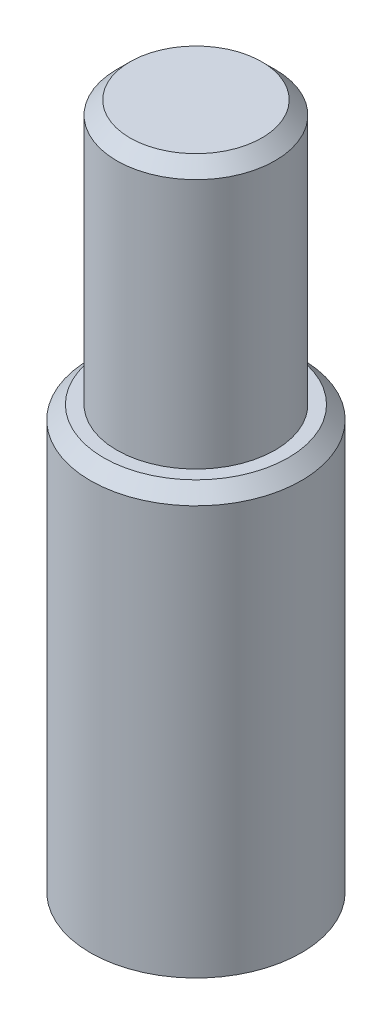
ISO-10303-21;
HEADER;
FILE_DESCRIPTION(('STEP AP214'),'2;1');
FILE_NAME('part.step','',(''),(''),'','','');
FILE_SCHEMA(('AUTOMOTIVE_DESIGN { 1 0 10303 214 1 1 1 1 }'));
ENDSEC;
DATA;
#1=APPLICATION_CONTEXT('core data for automotive mechanical design processes');
#2=APPLICATION_PROTOCOL_DEFINITION('international standard','automotive_design',2000,#1);
#3=PRODUCT_CONTEXT('',#1,'mechanical');
#4=PRODUCT('Part','Part','',(#3));
#5=PRODUCT_RELATED_PRODUCT_CATEGORY('part','',(#4));
#6=PRODUCT_DEFINITION_FORMATION('','',#4);
#7=PRODUCT_DEFINITION_CONTEXT('part definition',#1,'design');
#8=PRODUCT_DEFINITION('design','',#6,#7);
#9=PRODUCT_DEFINITION_SHAPE('','',#8);
#10=(LENGTH_UNIT() NAMED_UNIT(*) SI_UNIT(.MILLI.,.METRE.));
#11=(NAMED_UNIT(*) PLANE_ANGLE_UNIT() SI_UNIT($,.RADIAN.));
#12=(NAMED_UNIT(*) SI_UNIT($,.STERADIAN.) SOLID_ANGLE_UNIT());
#13=UNCERTAINTY_MEASURE_WITH_UNIT(LENGTH_MEASURE(1.E-05),#10,'distance_accuracy_value','');
#14=(GEOMETRIC_REPRESENTATION_CONTEXT(3) GLOBAL_UNCERTAINTY_ASSIGNED_CONTEXT((#13)) GLOBAL_UNIT_ASSIGNED_CONTEXT((#10,
#11,#12)) REPRESENTATION_CONTEXT('',''));
#15=CARTESIAN_POINT('',(0.,0.,0.));
#16=DIRECTION('',(0.,0.,1.));
#17=DIRECTION('',(1.,0.,0.));
#18=AXIS2_PLACEMENT_3D('',#15,#16,#17);
#19=CARTESIAN_POINT('',(0.,0.,0.));
#20=DIRECTION('',(0.,-1.,0.));
#21=DIRECTION('',(0.,0.,-1.));
#22=AXIS2_PLACEMENT_3D('',#19,#20,#21);
#23=PLANE('',#22);
#24=CARTESIAN_POINT('',(0.,0.,0.));
#25=DIRECTION('',(0.,-1.,0.));
#26=DIRECTION('',(0.,0.,-1.));
#27=AXIS2_PLACEMENT_3D('',#24,#25,#26);
#28=CIRCLE('',#27,3.4);
#29=CARTESIAN_POINT('',(0.,0.,-3.4));
#30=VERTEX_POINT('',#29);
#31=EDGE_CURVE('E60',#30,#30,#28,.T.);
#32=ORIENTED_EDGE('',*,*,#31,.F.);
#33=EDGE_LOOP('',(#32));
#34=FACE_BOUND('',#33,.T.);
#35=CARTESIAN_POINT('',(0.,0.,0.));
#36=DIRECTION('',(0.,1.,0.));
#37=DIRECTION('',(0.,0.,1.));
#38=AXIS2_PLACEMENT_3D('',#35,#36,#37);
#39=CIRCLE('',#38,7.99999999999999);
#40=CARTESIAN_POINT('',(0.,0.,7.99999999999999));
#41=VERTEX_POINT('',#40);
#42=EDGE_CURVE('E63',#41,#41,#39,.T.);
#43=ORIENTED_EDGE('',*,*,#42,.F.);
#44=EDGE_LOOP('',(#43));
#45=FACE_BOUND('',#44,.T.);
#46=ADVANCED_FACE('F39',(#34,#45),#23,.T.);
#47=CARTESIAN_POINT('',(0.,66.9238717339668,0.));
#48=DIRECTION('',(0.,1.,0.));
#49=DIRECTION('',(0.,0.,1.));
#50=AXIS2_PLACEMENT_3D('',#47,#48,#49);
#51=CYLINDRICAL_SURFACE('',#50,7.99999999999999);
#52=CARTESIAN_POINT('',(0.,31.,0.));
#53=DIRECTION('',(0.,1.,0.));
#54=DIRECTION('',(0.,0.,1.));
#55=AXIS2_PLACEMENT_3D('',#52,#53,#54);
#56=CIRCLE('',#55,7.99999999999999);
#57=CARTESIAN_POINT('',(0.,31.,7.99999999999999));
#58=VERTEX_POINT('',#57);
#59=EDGE_CURVE('E11',#58,#58,#56,.F.);
#60=ORIENTED_EDGE('',*,*,#59,.T.);
#61=EDGE_LOOP('',(#60));
#62=FACE_BOUND('',#61,.T.);
#63=ORIENTED_EDGE('',*,*,#42,.T.);
#64=EDGE_LOOP('',(#63));
#65=FACE_BOUND('',#64,.T.);
#66=ADVANCED_FACE('F90',(#62,#65),#51,.T.);
#67=CARTESIAN_POINT('',(-7.99999999999999,32.,0.));
#68=DIRECTION('',(0.,1.,0.));
#69=DIRECTION('',(0.,0.,1.));
#70=AXIS2_PLACEMENT_3D('',#67,#68,#69);
#71=PLANE('',#70);
#72=CARTESIAN_POINT('',(0.,32.,0.));
#73=DIRECTION('',(0.,1.,0.));
#74=DIRECTION('',(0.,0.,1.));
#75=AXIS2_PLACEMENT_3D('',#72,#73,#74);
#76=CIRCLE('',#75,6.99999999999999);
#77=CARTESIAN_POINT('',(0.,32.,6.99999999999999));
#78=VERTEX_POINT('',#77);
#79=EDGE_CURVE('E46',#78,#78,#76,.T.);
#80=ORIENTED_EDGE('',*,*,#79,.T.);
#81=EDGE_LOOP('',(#80));
#82=FACE_BOUND('',#81,.T.);
#83=CARTESIAN_POINT('',(0.,32.,0.));
#84=DIRECTION('',(0.,1.,0.));
#85=DIRECTION('',(0.,0.,1.));
#86=AXIS2_PLACEMENT_3D('',#83,#84,#85);
#87=CIRCLE('',#86,6.);
#88=CARTESIAN_POINT('',(0.,32.,6.));
#89=VERTEX_POINT('',#88);
#90=EDGE_CURVE('E59',#89,#89,#87,.T.);
#91=ORIENTED_EDGE('',*,*,#90,.F.);
#92=EDGE_LOOP('',(#91));
#93=FACE_BOUND('',#92,.T.);
#94=ADVANCED_FACE('F78',(#82,#93),#71,.T.);
#95=CARTESIAN_POINT('',(0.,66.9238717339668,0.));
#96=DIRECTION('',(0.,1.,0.));
#97=DIRECTION('',(0.,0.,1.));
#98=AXIS2_PLACEMENT_3D('',#95,#96,#97);
#99=CYLINDRICAL_SURFACE('',#98,6.);
#100=CARTESIAN_POINT('',(0.,51.,0.));
#101=DIRECTION('',(0.,1.,0.));
#102=DIRECTION('',(0.,0.,1.));
#103=AXIS2_PLACEMENT_3D('',#100,#101,#102);
#104=CIRCLE('',#103,6.);
#105=CARTESIAN_POINT('',(0.,51.,6.));
#106=VERTEX_POINT('',#105);
#107=EDGE_CURVE('E73',#106,#106,#104,.F.);
#108=ORIENTED_EDGE('',*,*,#107,.T.);
#109=EDGE_LOOP('',(#108));
#110=FACE_BOUND('',#109,.T.);
#111=ORIENTED_EDGE('',*,*,#90,.T.);
#112=EDGE_LOOP('',(#111));
#113=FACE_BOUND('',#112,.T.);
#114=ADVANCED_FACE('F103',(#110,#113),#99,.T.);
#115=CARTESIAN_POINT('',(-6.,52.,0.));
#116=DIRECTION('',(0.,1.,0.));
#117=DIRECTION('',(0.,0.,1.));
#118=AXIS2_PLACEMENT_3D('',#115,#116,#117);
#119=PLANE('',#118);
#120=CARTESIAN_POINT('',(0.,52.,0.));
#121=DIRECTION('',(0.,1.,0.));
#122=DIRECTION('',(0.,0.,1.));
#123=AXIS2_PLACEMENT_3D('',#120,#121,#122);
#124=CIRCLE('',#123,5.);
#125=CARTESIAN_POINT('',(0.,52.,5.));
#126=VERTEX_POINT('',#125);
#127=EDGE_CURVE('E70',#126,#126,#124,.T.);
#128=ORIENTED_EDGE('',*,*,#127,.T.);
#129=EDGE_LOOP('',(#128));
#130=FACE_BOUND('',#129,.T.);
#131=ADVANCED_FACE('F53',(#130),#119,.T.);
#132=CARTESIAN_POINT('',(0.,15.,0.));
#133=DIRECTION('',(0.,-1.,0.));
#134=DIRECTION('',(0.,0.,-1.));
#135=AXIS2_PLACEMENT_3D('',#132,#133,#134);
#136=CONICAL_SURFACE('',#135,3.4,1.02974425867665);
#137=CARTESIAN_POINT('',(0.,17.0429261046937,0.));
#138=VERTEX_POINT('',#137);
#139=VERTEX_LOOP('',#138);
#140=FACE_BOUND('',#139,.T.);
#141=CARTESIAN_POINT('',(0.,15.,0.));
#142=DIRECTION('',(0.,-1.,0.));
#143=DIRECTION('',(0.,0.,-1.));
#144=AXIS2_PLACEMENT_3D('',#141,#142,#143);
#145=CIRCLE('',#144,3.4);
#146=CARTESIAN_POINT('',(0.,15.,-3.4));
#147=VERTEX_POINT('',#146);
#148=EDGE_CURVE('E57',#147,#147,#145,.T.);
#149=ORIENTED_EDGE('',*,*,#148,.T.);
#150=EDGE_LOOP('',(#149));
#151=FACE_BOUND('',#150,.T.);
#152=ADVANCED_FACE('F49',(#140,#151),#136,.F.);
#153=CARTESIAN_POINT('',(0.,0.,0.));
#154=DIRECTION('',(0.,-1.,0.));
#155=DIRECTION('',(0.,0.,-1.));
#156=AXIS2_PLACEMENT_3D('',#153,#154,#155);
#157=CYLINDRICAL_SURFACE('',#156,3.4);
#158=ORIENTED_EDGE('',*,*,#148,.F.);
#159=EDGE_LOOP('',(#158));
#160=FACE_BOUND('',#159,.T.);
#161=ORIENTED_EDGE('',*,*,#31,.T.);
#162=EDGE_LOOP('',(#161));
#163=FACE_BOUND('',#162,.T.);
#164=ADVANCED_FACE('F52',(#160,#163),#157,.F.);
#165=CARTESIAN_POINT('',(0.,52.,0.));
#166=DIRECTION('',(0.,-1.,0.));
#167=DIRECTION('',(0.,0.,-1.));
#168=AXIS2_PLACEMENT_3D('',#165,#166,#167);
#169=CONICAL_SURFACE('',#168,5.,0.785398163397444);
#170=ORIENTED_EDGE('',*,*,#107,.F.);
#171=EDGE_LOOP('',(#170));
#172=FACE_BOUND('',#171,.T.);
#173=ORIENTED_EDGE('',*,*,#127,.F.);
#174=EDGE_LOOP('',(#173));
#175=FACE_BOUND('',#174,.T.);
#176=ADVANCED_FACE('F82',(#172,#175),#169,.T.);
#177=CARTESIAN_POINT('',(0.,32.,0.));
#178=DIRECTION('',(0.,-1.,0.));
#179=DIRECTION('',(0.,0.,-1.));
#180=AXIS2_PLACEMENT_3D('',#177,#178,#179);
#181=CONICAL_SURFACE('',#180,6.99999999999999,0.785398163397445);
#182=ORIENTED_EDGE('',*,*,#59,.F.);
#183=EDGE_LOOP('',(#182));
#184=FACE_BOUND('',#183,.T.);
#185=ORIENTED_EDGE('',*,*,#79,.F.);
#186=EDGE_LOOP('',(#185));
#187=FACE_BOUND('',#186,.T.);
#188=ADVANCED_FACE('F41',(#184,#187),#181,.T.);
#189=CLOSED_SHELL('',(#46,#66,#94,#114,#131,#152,#164,#176,#188));
#190=MANIFOLD_SOLID_BREP('B2',#189);
#191=ADVANCED_BREP_SHAPE_REPRESENTATION('',(#18,#190),#14);
#192=SHAPE_DEFINITION_REPRESENTATION(#9,#191);
ENDSEC;
END-ISO-10303-21;
